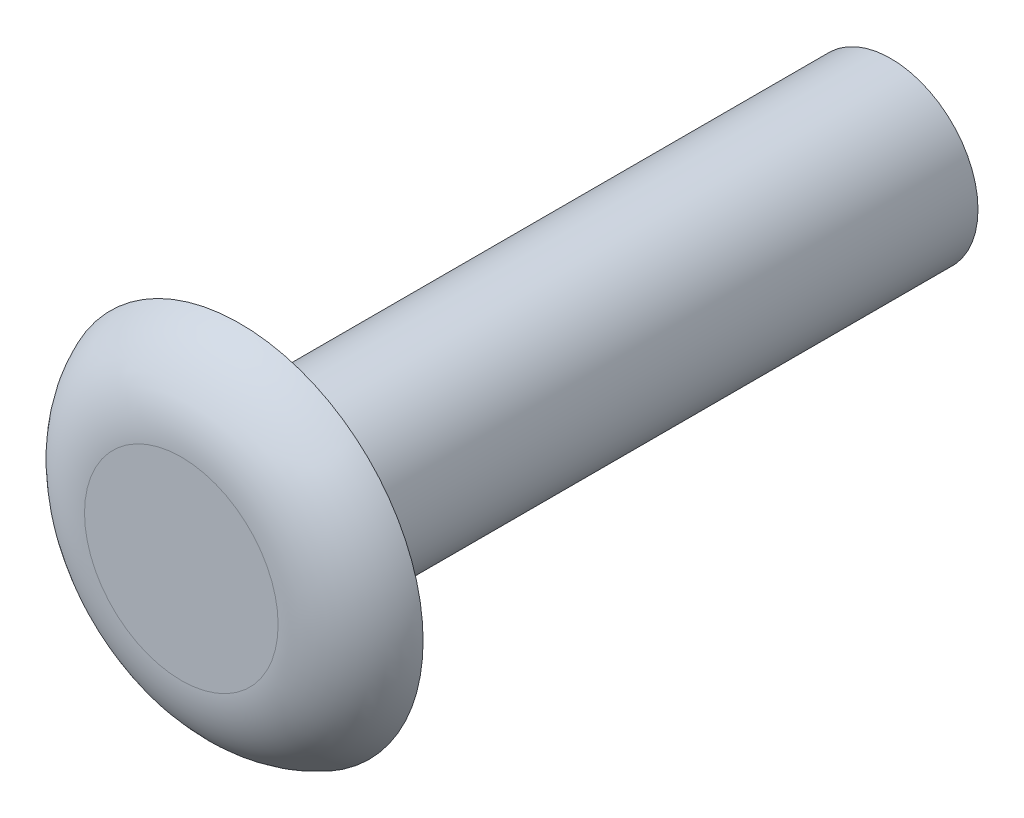
ISO-10303-21;
HEADER;
FILE_DESCRIPTION(('STEP AP214'),'2;1');
FILE_NAME('part.step','',(''),(''),'','','');
FILE_SCHEMA(('AUTOMOTIVE_DESIGN { 1 0 10303 214 1 1 1 1 }'));
ENDSEC;
DATA;
#1=APPLICATION_CONTEXT('core data for automotive mechanical design processes');
#2=APPLICATION_PROTOCOL_DEFINITION('international standard','automotive_design',2000,#1);
#3=PRODUCT_CONTEXT('',#1,'mechanical');
#4=PRODUCT('Part','Part','',(#3));
#5=PRODUCT_RELATED_PRODUCT_CATEGORY('part','',(#4));
#6=PRODUCT_DEFINITION_FORMATION('','',#4);
#7=PRODUCT_DEFINITION_CONTEXT('part definition',#1,'design');
#8=PRODUCT_DEFINITION('design','',#6,#7);
#9=PRODUCT_DEFINITION_SHAPE('','',#8);
#10=(LENGTH_UNIT() NAMED_UNIT(*) SI_UNIT(.MILLI.,.METRE.));
#11=(NAMED_UNIT(*) PLANE_ANGLE_UNIT() SI_UNIT($,.RADIAN.));
#12=(NAMED_UNIT(*) SI_UNIT($,.STERADIAN.) SOLID_ANGLE_UNIT());
#13=UNCERTAINTY_MEASURE_WITH_UNIT(LENGTH_MEASURE(1.E-05),#10,'distance_accuracy_value','');
#14=(GEOMETRIC_REPRESENTATION_CONTEXT(3) GLOBAL_UNCERTAINTY_ASSIGNED_CONTEXT((#13)) GLOBAL_UNIT_ASSIGNED_CONTEXT((#10,
#11,#12)) REPRESENTATION_CONTEXT('',''));
#15=CARTESIAN_POINT('',(0.,0.,0.));
#16=DIRECTION('',(0.,0.,1.));
#17=DIRECTION('',(1.,0.,0.));
#18=AXIS2_PLACEMENT_3D('',#15,#16,#17);
#19=CARTESIAN_POINT('',(0.,0.,1.6002));
#20=DIRECTION('',(0.,0.,1.));
#21=DIRECTION('',(1.,0.,0.));
#22=AXIS2_PLACEMENT_3D('',#19,#20,#21);
#23=PLANE('',#22);
#24=CARTESIAN_POINT('',(0.,0.,1.6002));
#25=DIRECTION('',(0.,0.,1.));
#26=DIRECTION('',(1.,0.,0.));
#27=AXIS2_PLACEMENT_3D('',#24,#25,#26);
#28=CIRCLE('',#27,2.64405934475841);
#29=CARTESIAN_POINT('',(2.64405934475841,0.,1.6002));
#30=VERTEX_POINT('',#29);
#31=EDGE_CURVE('E10',#30,#30,#28,.T.);
#32=ORIENTED_EDGE('',*,*,#31,.T.);
#33=EDGE_LOOP('',(#32));
#34=FACE_BOUND('',#33,.T.);
#35=ADVANCED_FACE('F32',(#34),#23,.T.);
#36=CARTESIAN_POINT('',(0.,0.,0.));
#37=DIRECTION('',(0.,0.,1.));
#38=DIRECTION('',(1.,0.,0.));
#39=AXIS2_PLACEMENT_3D('',#36,#37,#38);
#40=PLANE('',#39);
#41=CARTESIAN_POINT('',(0.,0.,0.));
#42=DIRECTION('',(0.,0.,1.));
#43=DIRECTION('',(1.,0.,0.));
#44=AXIS2_PLACEMENT_3D('',#41,#42,#43);
#45=CIRCLE('',#44,2.38125);
#46=CARTESIAN_POINT('',(2.38125,0.,0.));
#47=VERTEX_POINT('',#46);
#48=EDGE_CURVE('E47',#47,#47,#45,.T.);
#49=ORIENTED_EDGE('',*,*,#48,.T.);
#50=EDGE_LOOP('',(#49));
#51=FACE_BOUND('',#50,.T.);
#52=CARTESIAN_POINT('',(0.,0.,0.));
#53=DIRECTION('',(0.,0.,1.));
#54=DIRECTION('',(1.,0.,0.));
#55=AXIS2_PLACEMENT_3D('',#52,#53,#54);
#56=CIRCLE('',#55,5.0038);
#57=CARTESIAN_POINT('',(5.0038,0.,0.));
#58=VERTEX_POINT('',#57);
#59=EDGE_CURVE('E39',#58,#58,#56,.T.);
#60=ORIENTED_EDGE('',*,*,#59,.F.);
#61=EDGE_LOOP('',(#60));
#62=FACE_BOUND('',#61,.T.);
#63=ADVANCED_FACE('F53',(#51,#62),#40,.F.);
#64=CARTESIAN_POINT('',(0.,0.,-17.78));
#65=DIRECTION('',(0.,0.,1.));
#66=DIRECTION('',(1.,0.,0.));
#67=AXIS2_PLACEMENT_3D('',#64,#65,#66);
#68=CYLINDRICAL_SURFACE('',#67,2.38125);
#69=CARTESIAN_POINT('',(0.,0.,-17.78));
#70=DIRECTION('',(0.,0.,1.));
#71=DIRECTION('',(1.,0.,0.));
#72=AXIS2_PLACEMENT_3D('',#69,#70,#71);
#73=CIRCLE('',#72,2.38125);
#74=CARTESIAN_POINT('',(2.38125,0.,-17.78));
#75=VERTEX_POINT('',#74);
#76=EDGE_CURVE('E43',#75,#75,#73,.T.);
#77=ORIENTED_EDGE('',*,*,#76,.T.);
#78=EDGE_LOOP('',(#77));
#79=FACE_BOUND('',#78,.T.);
#80=ORIENTED_EDGE('',*,*,#48,.F.);
#81=EDGE_LOOP('',(#80));
#82=FACE_BOUND('',#81,.T.);
#83=ADVANCED_FACE('F56',(#79,#82),#68,.T.);
#84=CARTESIAN_POINT('',(0.,0.,-17.78));
#85=DIRECTION('',(0.,0.,1.));
#86=DIRECTION('',(1.,0.,0.));
#87=AXIS2_PLACEMENT_3D('',#84,#85,#86);
#88=PLANE('',#87);
#89=ORIENTED_EDGE('',*,*,#76,.F.);
#90=EDGE_LOOP('',(#89));
#91=FACE_BOUND('',#90,.T.);
#92=ADVANCED_FACE('F58',(#91),#88,.F.);
#93=CARTESIAN_POINT('',(0.,0.,-0.9398));
#94=DIRECTION('',(0.,0.,-1.));
#95=DIRECTION('',(-1.,0.,0.));
#96=AXIS2_PLACEMENT_3D('',#93,#94,#95);
#97=TOROIDAL_SURFACE('',#96,2.64405934475841,2.54);
#98=ORIENTED_EDGE('',*,*,#59,.T.);
#99=EDGE_LOOP('',(#98));
#100=FACE_BOUND('',#99,.T.);
#101=ORIENTED_EDGE('',*,*,#31,.F.);
#102=EDGE_LOOP('',(#101));
#103=FACE_BOUND('',#102,.T.);
#104=ADVANCED_FACE('F34',(#100,#103),#97,.T.);
#105=CLOSED_SHELL('',(#35,#63,#83,#92,#104));
#106=MANIFOLD_SOLID_BREP('B2',#105);
#107=ADVANCED_BREP_SHAPE_REPRESENTATION('',(#18,#106),#14);
#108=SHAPE_DEFINITION_REPRESENTATION(#9,#107);
ENDSEC;
END-ISO-10303-21;
